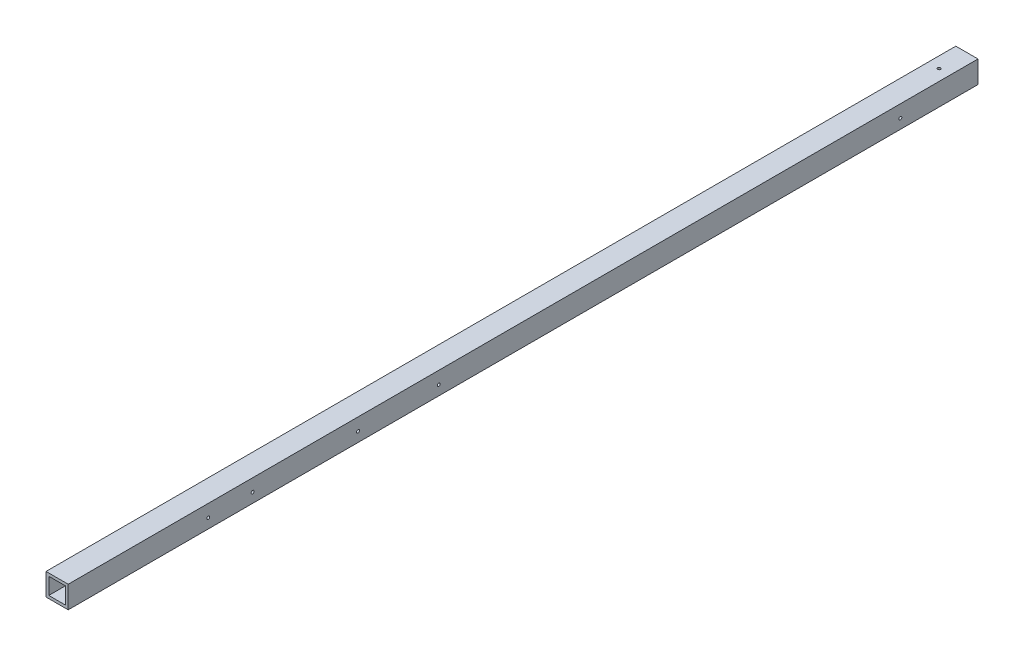
ISO-10303-21;
HEADER;
FILE_DESCRIPTION(('STEP AP214'),'2;1');
FILE_NAME('part.step','',(''),(''),'','','');
FILE_SCHEMA(('AUTOMOTIVE_DESIGN { 1 0 10303 214 1 1 1 1 }'));
ENDSEC;
DATA;
#1=APPLICATION_CONTEXT('core data for automotive mechanical design processes');
#2=APPLICATION_PROTOCOL_DEFINITION('international standard','automotive_design',2000,#1);
#3=PRODUCT_CONTEXT('',#1,'mechanical');
#4=PRODUCT('Part','Part','',(#3));
#5=PRODUCT_RELATED_PRODUCT_CATEGORY('part','',(#4));
#6=PRODUCT_DEFINITION_FORMATION('','',#4);
#7=PRODUCT_DEFINITION_CONTEXT('part definition',#1,'design');
#8=PRODUCT_DEFINITION('design','',#6,#7);
#9=PRODUCT_DEFINITION_SHAPE('','',#8);
#10=(LENGTH_UNIT() NAMED_UNIT(*) SI_UNIT(.MILLI.,.METRE.));
#11=(NAMED_UNIT(*) PLANE_ANGLE_UNIT() SI_UNIT($,.RADIAN.));
#12=(NAMED_UNIT(*) SI_UNIT($,.STERADIAN.) SOLID_ANGLE_UNIT());
#13=UNCERTAINTY_MEASURE_WITH_UNIT(LENGTH_MEASURE(1.E-05),#10,'distance_accuracy_value','');
#14=(GEOMETRIC_REPRESENTATION_CONTEXT(3) GLOBAL_UNCERTAINTY_ASSIGNED_CONTEXT((#13)) GLOBAL_UNIT_ASSIGNED_CONTEXT((#10,
#11,#12)) REPRESENTATION_CONTEXT('',''));
#15=CARTESIAN_POINT('',(0.,0.,0.));
#16=DIRECTION('',(0.,0.,1.));
#17=DIRECTION('',(1.,0.,0.));
#18=AXIS2_PLACEMENT_3D('',#15,#16,#17);
#19=CARTESIAN_POINT('',(-2287.62139438171,-193.675,1762.125));
#20=DIRECTION('',(1.,0.,0.));
#21=DIRECTION('',(0.,0.,-1.));
#22=AXIS2_PLACEMENT_3D('',#19,#20,#21);
#23=CYLINDRICAL_SURFACE('',#22,3.3782);
#24=CARTESIAN_POINT('',(-209.55,-193.675,1762.125));
#25=DIRECTION('',(1.,0.,0.));
#26=DIRECTION('',(0.,0.,-1.));
#27=AXIS2_PLACEMENT_3D('',#24,#25,#26);
#28=CIRCLE('',#27,3.3782);
#29=CARTESIAN_POINT('',(-209.55,-193.675,1758.7468));
#30=VERTEX_POINT('',#29);
#31=EDGE_CURVE('E157',#30,#30,#28,.F.);
#32=ORIENTED_EDGE('',*,*,#31,.F.);
#33=EDGE_LOOP('',(#32));
#34=FACE_BOUND('',#33,.T.);
#35=CARTESIAN_POINT('',(-212.028435125498,-193.675,1762.125));
#36=DIRECTION('',(-1.,0.,0.));
#37=DIRECTION('',(0.,0.,1.));
#38=AXIS2_PLACEMENT_3D('',#35,#36,#37);
#39=CIRCLE('',#38,3.3782);
#40=CARTESIAN_POINT('',(-212.028435125498,-193.675,1765.5032));
#41=VERTEX_POINT('',#40);
#42=EDGE_CURVE('E222',#41,#41,#39,.T.);
#43=ORIENTED_EDGE('',*,*,#42,.T.);
#44=EDGE_LOOP('',(#43));
#45=FACE_BOUND('',#44,.T.);
#46=ADVANCED_FACE('F14',(#34,#45),#23,.F.);
#47=CARTESIAN_POINT('',(-2287.62139438171,-193.675,1660.525));
#48=DIRECTION('',(1.,0.,0.));
#49=DIRECTION('',(0.,0.,-1.));
#50=AXIS2_PLACEMENT_3D('',#47,#48,#49);
#51=CYLINDRICAL_SURFACE('',#50,3.3782);
#52=CARTESIAN_POINT('',(-209.55,-193.675,1660.525));
#53=DIRECTION('',(1.,0.,0.));
#54=DIRECTION('',(0.,0.,-1.));
#55=AXIS2_PLACEMENT_3D('',#52,#53,#54);
#56=CIRCLE('',#55,3.3782);
#57=CARTESIAN_POINT('',(-209.55,-193.675,1657.1468));
#58=VERTEX_POINT('',#57);
#59=EDGE_CURVE('E163',#58,#58,#56,.F.);
#60=ORIENTED_EDGE('',*,*,#59,.F.);
#61=EDGE_LOOP('',(#60));
#62=FACE_BOUND('',#61,.T.);
#63=CARTESIAN_POINT('',(-212.028435125498,-193.675,1660.525));
#64=DIRECTION('',(-1.,0.,0.));
#65=DIRECTION('',(0.,0.,1.));
#66=AXIS2_PLACEMENT_3D('',#63,#64,#65);
#67=CIRCLE('',#66,3.3782);
#68=CARTESIAN_POINT('',(-212.028435125498,-193.675,1663.9032));
#69=VERTEX_POINT('',#68);
#70=EDGE_CURVE('E168',#69,#69,#67,.T.);
#71=ORIENTED_EDGE('',*,*,#70,.T.);
#72=EDGE_LOOP('',(#71));
#73=FACE_BOUND('',#72,.T.);
#74=ADVANCED_FACE('F330',(#62,#73),#51,.F.);
#75=CARTESIAN_POINT('',(-190.5,-171.45,2082.8));
#76=DIRECTION('',(0.,-1.,0.));
#77=DIRECTION('',(0.,0.,-1.));
#78=AXIS2_PLACEMENT_3D('',#75,#76,#77);
#79=PLANE('',#78);
#80=CARTESIAN_POINT('',(-190.5,-171.45,63.5));
#81=DIRECTION('',(0.,-1.,0.));
#82=DIRECTION('',(0.,0.,-1.));
#83=AXIS2_PLACEMENT_3D('',#80,#81,#82);
#84=CIRCLE('',#83,3.3655);
#85=CARTESIAN_POINT('',(-190.5,-171.45,60.1345));
#86=VERTEX_POINT('',#85);
#87=EDGE_CURVE('E252',#86,#86,#84,.F.);
#88=ORIENTED_EDGE('',*,*,#87,.T.);
#89=EDGE_LOOP('',(#88));
#90=FACE_BOUND('',#89,.T.);
#91=DIRECTION('',(-1.,0.,0.));
#92=VECTOR('',#91,1.);
#93=CARTESIAN_POINT('',(-190.5,-171.45,0.));
#94=LINE('',#93,#92);
#95=CARTESIAN_POINT('',(-171.45,-171.45,0.));
#96=VERTEX_POINT('',#95);
#97=CARTESIAN_POINT('',(-209.55,-171.45,0.));
#98=VERTEX_POINT('',#97);
#99=EDGE_CURVE('E289',#96,#98,#94,.T.);
#100=ORIENTED_EDGE('',*,*,#99,.F.);
#101=DIRECTION('',(0.,0.,-1.));
#102=VECTOR('',#101,1.);
#103=CARTESIAN_POINT('',(-171.45,-171.45,2082.8));
#104=LINE('',#103,#102);
#105=CARTESIAN_POINT('',(-171.45,-171.45,2082.8));
#106=VERTEX_POINT('',#105);
#107=EDGE_CURVE('E9',#106,#96,#104,.T.);
#108=ORIENTED_EDGE('',*,*,#107,.F.);
#109=DIRECTION('',(-1.,0.,0.));
#110=VECTOR('',#109,1.);
#111=CARTESIAN_POINT('',(-190.5,-171.45,2082.8));
#112=LINE('',#111,#110);
#113=CARTESIAN_POINT('',(-209.55,-171.45,2082.8));
#114=VERTEX_POINT('',#113);
#115=EDGE_CURVE('E124',#106,#114,#112,.T.);
#116=ORIENTED_EDGE('',*,*,#115,.T.);
#117=DIRECTION('',(0.,0.,-1.));
#118=VECTOR('',#117,1.);
#119=CARTESIAN_POINT('',(-209.55,-171.45,2082.8));
#120=LINE('',#119,#118);
#121=EDGE_CURVE('E39',#114,#98,#120,.T.);
#122=ORIENTED_EDGE('',*,*,#121,.T.);
#123=EDGE_LOOP('',(#100,#108,#116,#122));
#124=FACE_BOUND('',#123,.T.);
#125=ADVANCED_FACE('F337',(#90,#124),#79,.T.);
#126=CARTESIAN_POINT('',(-171.45,-190.5,2082.8));
#127=DIRECTION('',(1.,0.,0.));
#128=DIRECTION('',(0.,0.,-1.));
#129=AXIS2_PLACEMENT_3D('',#126,#127,#128);
#130=PLANE('',#129);
#131=CARTESIAN_POINT('',(-171.45,-193.675,1419.225));
#132=DIRECTION('',(1.,0.,0.));
#133=DIRECTION('',(0.,0.,-1.));
#134=AXIS2_PLACEMENT_3D('',#131,#132,#133);
#135=CIRCLE('',#134,3.3782);
#136=CARTESIAN_POINT('',(-171.45,-193.675,1415.8468));
#137=VERTEX_POINT('',#136);
#138=EDGE_CURVE('E198',#137,#137,#135,.F.);
#139=ORIENTED_EDGE('',*,*,#138,.F.);
#140=EDGE_LOOP('',(#139));
#141=FACE_BOUND('',#140,.T.);
#142=CARTESIAN_POINT('',(-171.45,-193.675,177.8));
#143=DIRECTION('',(1.,0.,0.));
#144=DIRECTION('',(0.,0.,-1.));
#145=AXIS2_PLACEMENT_3D('',#142,#143,#144);
#146=CIRCLE('',#145,3.3782);
#147=CARTESIAN_POINT('',(-171.45,-193.675,174.4218));
#148=VERTEX_POINT('',#147);
#149=EDGE_CURVE('E186',#148,#148,#146,.F.);
#150=ORIENTED_EDGE('',*,*,#149,.F.);
#151=EDGE_LOOP('',(#150));
#152=FACE_BOUND('',#151,.T.);
#153=CARTESIAN_POINT('',(-171.45,-193.675,1234.5416));
#154=DIRECTION('',(1.,0.,0.));
#155=DIRECTION('',(0.,0.,-1.));
#156=AXIS2_PLACEMENT_3D('',#153,#154,#155);
#157=CIRCLE('',#156,3.3782);
#158=CARTESIAN_POINT('',(-171.45,-193.675,1231.1634));
#159=VERTEX_POINT('',#158);
#160=EDGE_CURVE('E214',#159,#159,#157,.F.);
#161=ORIENTED_EDGE('',*,*,#160,.F.);
#162=EDGE_LOOP('',(#161));
#163=FACE_BOUND('',#162,.T.);
#164=CARTESIAN_POINT('',(-171.45,-193.675,1660.525));
#165=DIRECTION('',(1.,0.,0.));
#166=DIRECTION('',(0.,0.,-1.));
#167=AXIS2_PLACEMENT_3D('',#164,#165,#166);
#168=CIRCLE('',#167,3.3782);
#169=CARTESIAN_POINT('',(-171.45,-193.675,1657.1468));
#170=VERTEX_POINT('',#169);
#171=EDGE_CURVE('E162',#170,#170,#168,.F.);
#172=ORIENTED_EDGE('',*,*,#171,.F.);
#173=EDGE_LOOP('',(#172));
#174=FACE_BOUND('',#173,.T.);
#175=CARTESIAN_POINT('',(-171.45,-193.675,1762.125));
#176=DIRECTION('',(1.,0.,0.));
#177=DIRECTION('',(0.,0.,-1.));
#178=AXIS2_PLACEMENT_3D('',#175,#176,#177);
#179=CIRCLE('',#178,3.3782);
#180=CARTESIAN_POINT('',(-171.45,-193.675,1758.7468));
#181=VERTEX_POINT('',#180);
#182=EDGE_CURVE('E242',#181,#181,#179,.F.);
#183=ORIENTED_EDGE('',*,*,#182,.F.);
#184=EDGE_LOOP('',(#183));
#185=FACE_BOUND('',#184,.T.);
#186=DIRECTION('',(0.,-1.,0.));
#187=VECTOR('',#186,1.);
#188=CARTESIAN_POINT('',(-171.45,-190.5,0.));
#189=LINE('',#188,#187);
#190=CARTESIAN_POINT('',(-171.45,-209.55,0.));
#191=VERTEX_POINT('',#190);
#192=EDGE_CURVE('E130',#96,#191,#189,.T.);
#193=ORIENTED_EDGE('',*,*,#192,.T.);
#194=DIRECTION('',(0.,0.,-1.));
#195=VECTOR('',#194,1.);
#196=CARTESIAN_POINT('',(-171.45,-209.55,2082.8));
#197=LINE('',#196,#195);
#198=CARTESIAN_POINT('',(-171.45,-209.55,2082.8));
#199=VERTEX_POINT('',#198);
#200=EDGE_CURVE('E25',#199,#191,#197,.T.);
#201=ORIENTED_EDGE('',*,*,#200,.F.);
#202=DIRECTION('',(0.,-1.,0.));
#203=VECTOR('',#202,1.);
#204=CARTESIAN_POINT('',(-171.45,-190.5,2082.8));
#205=LINE('',#204,#203);
#206=EDGE_CURVE('E119',#106,#199,#205,.T.);
#207=ORIENTED_EDGE('',*,*,#206,.F.);
#208=ORIENTED_EDGE('',*,*,#107,.T.);
#209=EDGE_LOOP('',(#193,#201,#207,#208));
#210=FACE_BOUND('',#209,.T.);
#211=ADVANCED_FACE('F128',(#141,#152,#163,#174,#185,#210),#130,.F.);
#212=CARTESIAN_POINT('',(-190.5,-209.55,2082.8));
#213=DIRECTION('',(0.,-1.,0.));
#214=DIRECTION('',(0.,0.,-1.));
#215=AXIS2_PLACEMENT_3D('',#212,#213,#214);
#216=PLANE('',#215);
#217=CARTESIAN_POINT('',(-190.5,-209.55,63.5));
#218=DIRECTION('',(0.,-1.,0.));
#219=DIRECTION('',(0.,0.,-1.));
#220=AXIS2_PLACEMENT_3D('',#217,#218,#219);
#221=CIRCLE('',#220,3.3655);
#222=CARTESIAN_POINT('',(-190.5,-209.55,60.1345));
#223=VERTEX_POINT('',#222);
#224=EDGE_CURVE('E155',#223,#223,#221,.F.);
#225=ORIENTED_EDGE('',*,*,#224,.F.);
#226=EDGE_LOOP('',(#225));
#227=FACE_BOUND('',#226,.T.);
#228=DIRECTION('',(-1.,0.,0.));
#229=VECTOR('',#228,1.);
#230=CARTESIAN_POINT('',(-190.5,-209.55,0.));
#231=LINE('',#230,#229);
#232=CARTESIAN_POINT('',(-209.55,-209.55,0.));
#233=VERTEX_POINT('',#232);
#234=EDGE_CURVE('E294',#191,#233,#231,.T.);
#235=ORIENTED_EDGE('',*,*,#234,.T.);
#236=DIRECTION('',(0.,0.,-1.));
#237=VECTOR('',#236,1.);
#238=CARTESIAN_POINT('',(-209.55,-209.55,2082.8));
#239=LINE('',#238,#237);
#240=CARTESIAN_POINT('',(-209.55,-209.55,2082.8));
#241=VERTEX_POINT('',#240);
#242=EDGE_CURVE('E74',#241,#233,#239,.T.);
#243=ORIENTED_EDGE('',*,*,#242,.F.);
#244=DIRECTION('',(-1.,0.,0.));
#245=VECTOR('',#244,1.);
#246=CARTESIAN_POINT('',(-190.5,-209.55,2082.8));
#247=LINE('',#246,#245);
#248=EDGE_CURVE('E110',#199,#241,#247,.T.);
#249=ORIENTED_EDGE('',*,*,#248,.F.);
#250=ORIENTED_EDGE('',*,*,#200,.T.);
#251=EDGE_LOOP('',(#235,#243,#249,#250));
#252=FACE_BOUND('',#251,.T.);
#253=ADVANCED_FACE('F112',(#227,#252),#216,.F.);
#254=CARTESIAN_POINT('',(-215.9,-190.5,2082.8));
#255=DIRECTION('',(-1.,0.,0.));
#256=DIRECTION('',(0.,0.,1.));
#257=AXIS2_PLACEMENT_3D('',#254,#255,#256);
#258=PLANE('',#257);
#259=CARTESIAN_POINT('',(-215.9,-193.675,1419.225));
#260=DIRECTION('',(-1.,0.,0.));
#261=DIRECTION('',(0.,0.,1.));
#262=AXIS2_PLACEMENT_3D('',#259,#260,#261);
#263=CIRCLE('',#262,6.74369999999991);
#264=CARTESIAN_POINT('',(-215.9,-193.675,1425.9687));
#265=VERTEX_POINT('',#264);
#266=EDGE_CURVE('E592',#265,#265,#263,.T.);
#267=ORIENTED_EDGE('',*,*,#266,.F.);
#268=EDGE_LOOP('',(#267));
#269=FACE_BOUND('',#268,.T.);
#270=CARTESIAN_POINT('',(-215.9,-193.675,177.8));
#271=DIRECTION('',(-1.,0.,0.));
#272=DIRECTION('',(0.,0.,1.));
#273=AXIS2_PLACEMENT_3D('',#270,#271,#272);
#274=CIRCLE('',#273,6.7437);
#275=CARTESIAN_POINT('',(-215.9,-193.675,184.5437));
#276=VERTEX_POINT('',#275);
#277=EDGE_CURVE('E190',#276,#276,#274,.T.);
#278=ORIENTED_EDGE('',*,*,#277,.F.);
#279=EDGE_LOOP('',(#278));
#280=FACE_BOUND('',#279,.T.);
#281=CARTESIAN_POINT('',(-215.9,-193.675,1234.5416));
#282=DIRECTION('',(-1.,0.,0.));
#283=DIRECTION('',(0.,0.,1.));
#284=AXIS2_PLACEMENT_3D('',#281,#282,#283);
#285=CIRCLE('',#284,6.74369999999991);
#286=CARTESIAN_POINT('',(-215.9,-193.675,1241.2853));
#287=VERTEX_POINT('',#286);
#288=EDGE_CURVE('E204',#287,#287,#285,.T.);
#289=ORIENTED_EDGE('',*,*,#288,.F.);
#290=EDGE_LOOP('',(#289));
#291=FACE_BOUND('',#290,.T.);
#292=CARTESIAN_POINT('',(-215.9,-193.675,1762.125));
#293=DIRECTION('',(-1.,0.,0.));
#294=DIRECTION('',(0.,0.,1.));
#295=AXIS2_PLACEMENT_3D('',#292,#293,#294);
#296=CIRCLE('',#295,6.74369999999991);
#297=CARTESIAN_POINT('',(-215.9,-193.675,1768.8687));
#298=VERTEX_POINT('',#297);
#299=EDGE_CURVE('E218',#298,#298,#296,.T.);
#300=ORIENTED_EDGE('',*,*,#299,.F.);
#301=EDGE_LOOP('',(#300));
#302=FACE_BOUND('',#301,.T.);
#303=CARTESIAN_POINT('',(-215.9,-193.675,1660.525));
#304=DIRECTION('',(-1.,0.,0.));
#305=DIRECTION('',(0.,0.,1.));
#306=AXIS2_PLACEMENT_3D('',#303,#304,#305);
#307=CIRCLE('',#306,6.74369999999991);
#308=CARTESIAN_POINT('',(-215.9,-193.675,1667.2687));
#309=VERTEX_POINT('',#308);
#310=EDGE_CURVE('E226',#309,#309,#307,.T.);
#311=ORIENTED_EDGE('',*,*,#310,.F.);
#312=EDGE_LOOP('',(#311));
#313=FACE_BOUND('',#312,.T.);
#314=DIRECTION('',(0.,1.,0.));
#315=VECTOR('',#314,1.);
#316=CARTESIAN_POINT('',(-215.9,-190.5,0.));
#317=LINE('',#316,#315);
#318=CARTESIAN_POINT('',(-215.9,-215.9,0.));
#319=VERTEX_POINT('',#318);
#320=CARTESIAN_POINT('',(-215.9,-165.1,0.));
#321=VERTEX_POINT('',#320);
#322=EDGE_CURVE('E256',#319,#321,#317,.T.);
#323=ORIENTED_EDGE('',*,*,#322,.F.);
#324=DIRECTION('',(0.,0.,-1.));
#325=VECTOR('',#324,1.);
#326=CARTESIAN_POINT('',(-215.9,-215.9,2082.8));
#327=LINE('',#326,#325);
#328=CARTESIAN_POINT('',(-215.9,-215.9,2082.8));
#329=VERTEX_POINT('',#328);
#330=EDGE_CURVE('E90',#329,#319,#327,.T.);
#331=ORIENTED_EDGE('',*,*,#330,.F.);
#332=DIRECTION('',(0.,1.,0.));
#333=VECTOR('',#332,1.);
#334=CARTESIAN_POINT('',(-215.9,-190.5,2082.8));
#335=LINE('',#334,#333);
#336=CARTESIAN_POINT('',(-215.9,-165.1,2082.8));
#337=VERTEX_POINT('',#336);
#338=EDGE_CURVE('E257',#329,#337,#335,.T.);
#339=ORIENTED_EDGE('',*,*,#338,.T.);
#340=DIRECTION('',(0.,0.,-1.));
#341=VECTOR('',#340,1.);
#342=CARTESIAN_POINT('',(-215.9,-165.1,2082.8));
#343=LINE('',#342,#341);
#344=EDGE_CURVE('E139',#337,#321,#343,.T.);
#345=ORIENTED_EDGE('',*,*,#344,.T.);
#346=EDGE_LOOP('',(#323,#331,#339,#345));
#347=FACE_BOUND('',#346,.T.);
#348=ADVANCED_FACE('F16',(#269,#280,#291,#302,#313,#347),#258,.T.);
#349=CARTESIAN_POINT('',(-190.5,-215.9,2082.8));
#350=DIRECTION('',(0.,1.,0.));
#351=DIRECTION('',(0.,0.,1.));
#352=AXIS2_PLACEMENT_3D('',#349,#350,#351);
#353=PLANE('',#352);
#354=CARTESIAN_POINT('',(-190.5,-215.9,63.5));
#355=DIRECTION('',(0.,-1.,0.));
#356=DIRECTION('',(0.,0.,-1.));
#357=AXIS2_PLACEMENT_3D('',#354,#355,#356);
#358=CIRCLE('',#357,3.3655);
#359=CARTESIAN_POINT('',(-190.5,-215.9,60.1345));
#360=VERTEX_POINT('',#359);
#361=EDGE_CURVE('E156',#360,#360,#358,.T.);
#362=ORIENTED_EDGE('',*,*,#361,.F.);
#363=EDGE_LOOP('',(#362));
#364=FACE_BOUND('',#363,.T.);
#365=DIRECTION('',(1.,0.,0.));
#366=VECTOR('',#365,1.);
#367=CARTESIAN_POINT('',(-190.5,-215.9,0.));
#368=LINE('',#367,#366);
#369=CARTESIAN_POINT('',(-165.1,-215.9,0.));
#370=VERTEX_POINT('',#369);
#371=EDGE_CURVE('E278',#319,#370,#368,.T.);
#372=ORIENTED_EDGE('',*,*,#371,.T.);
#373=DIRECTION('',(0.,0.,-1.));
#374=VECTOR('',#373,1.);
#375=CARTESIAN_POINT('',(-165.1,-215.9,2082.8));
#376=LINE('',#375,#374);
#377=CARTESIAN_POINT('',(-165.1,-215.9,2082.8));
#378=VERTEX_POINT('',#377);
#379=EDGE_CURVE('E145',#378,#370,#376,.T.);
#380=ORIENTED_EDGE('',*,*,#379,.F.);
#381=DIRECTION('',(1.,0.,0.));
#382=VECTOR('',#381,1.);
#383=CARTESIAN_POINT('',(-190.5,-215.9,2082.8));
#384=LINE('',#383,#382);
#385=EDGE_CURVE('E260',#329,#378,#384,.T.);
#386=ORIENTED_EDGE('',*,*,#385,.F.);
#387=ORIENTED_EDGE('',*,*,#330,.T.);
#388=EDGE_LOOP('',(#372,#380,#386,#387));
#389=FACE_BOUND('',#388,.T.);
#390=ADVANCED_FACE('F373',(#364,#389),#353,.F.);
#391=CARTESIAN_POINT('',(-165.1,-190.5,2082.8));
#392=DIRECTION('',(-1.,0.,0.));
#393=DIRECTION('',(0.,0.,1.));
#394=AXIS2_PLACEMENT_3D('',#391,#392,#393);
#395=PLANE('',#394);
#396=CARTESIAN_POINT('',(-165.1,-193.675,1419.225));
#397=DIRECTION('',(-1.,0.,0.));
#398=DIRECTION('',(0.,0.,1.));
#399=AXIS2_PLACEMENT_3D('',#396,#397,#398);
#400=CIRCLE('',#399,3.3782);
#401=CARTESIAN_POINT('',(-165.1,-193.675,1422.6032));
#402=VERTEX_POINT('',#401);
#403=EDGE_CURVE('E552',#402,#402,#400,.F.);
#404=ORIENTED_EDGE('',*,*,#403,.F.);
#405=EDGE_LOOP('',(#404));
#406=FACE_BOUND('',#405,.T.);
#407=CARTESIAN_POINT('',(-165.1,-193.675,177.8));
#408=DIRECTION('',(-1.,0.,0.));
#409=DIRECTION('',(0.,0.,1.));
#410=AXIS2_PLACEMENT_3D('',#407,#408,#409);
#411=CIRCLE('',#410,3.3782);
#412=CARTESIAN_POINT('',(-165.1,-193.675,181.1782));
#413=VERTEX_POINT('',#412);
#414=EDGE_CURVE('E177',#413,#413,#411,.F.);
#415=ORIENTED_EDGE('',*,*,#414,.F.);
#416=EDGE_LOOP('',(#415));
#417=FACE_BOUND('',#416,.T.);
#418=CARTESIAN_POINT('',(-165.1,-193.675,1234.5416));
#419=DIRECTION('',(-1.,0.,0.));
#420=DIRECTION('',(0.,0.,1.));
#421=AXIS2_PLACEMENT_3D('',#418,#419,#420);
#422=CIRCLE('',#421,3.3782);
#423=CARTESIAN_POINT('',(-165.1,-193.675,1237.9198));
#424=VERTEX_POINT('',#423);
#425=EDGE_CURVE('E172',#424,#424,#422,.F.);
#426=ORIENTED_EDGE('',*,*,#425,.F.);
#427=EDGE_LOOP('',(#426));
#428=FACE_BOUND('',#427,.T.);
#429=CARTESIAN_POINT('',(-165.1,-193.675,1660.525));
#430=DIRECTION('',(-1.,0.,0.));
#431=DIRECTION('',(0.,0.,1.));
#432=AXIS2_PLACEMENT_3D('',#429,#430,#431);
#433=CIRCLE('',#432,3.3782);
#434=CARTESIAN_POINT('',(-165.1,-193.675,1663.9032));
#435=VERTEX_POINT('',#434);
#436=EDGE_CURVE('E167',#435,#435,#433,.F.);
#437=ORIENTED_EDGE('',*,*,#436,.F.);
#438=EDGE_LOOP('',(#437));
#439=FACE_BOUND('',#438,.T.);
#440=CARTESIAN_POINT('',(-165.1,-193.675,1762.125));
#441=DIRECTION('',(-1.,0.,0.));
#442=DIRECTION('',(0.,0.,1.));
#443=AXIS2_PLACEMENT_3D('',#440,#441,#442);
#444=CIRCLE('',#443,3.3782);
#445=CARTESIAN_POINT('',(-165.1,-193.675,1765.5032));
#446=VERTEX_POINT('',#445);
#447=EDGE_CURVE('E161',#446,#446,#444,.F.);
#448=ORIENTED_EDGE('',*,*,#447,.F.);
#449=EDGE_LOOP('',(#448));
#450=FACE_BOUND('',#449,.T.);
#451=DIRECTION('',(0.,1.,0.));
#452=VECTOR('',#451,1.);
#453=CARTESIAN_POINT('',(-165.1,-190.5,0.));
#454=LINE('',#453,#452);
#455=CARTESIAN_POINT('',(-165.1,-165.1,0.));
#456=VERTEX_POINT('',#455);
#457=EDGE_CURVE('E281',#370,#456,#454,.T.);
#458=ORIENTED_EDGE('',*,*,#457,.T.);
#459=DIRECTION('',(0.,0.,-1.));
#460=VECTOR('',#459,1.);
#461=CARTESIAN_POINT('',(-165.1,-165.1,2082.8));
#462=LINE('',#461,#460);
#463=CARTESIAN_POINT('',(-165.1,-165.1,2082.8));
#464=VERTEX_POINT('',#463);
#465=EDGE_CURVE('E142',#464,#456,#462,.T.);
#466=ORIENTED_EDGE('',*,*,#465,.F.);
#467=DIRECTION('',(0.,1.,0.));
#468=VECTOR('',#467,1.);
#469=CARTESIAN_POINT('',(-165.1,-190.5,2082.8));
#470=LINE('',#469,#468);
#471=EDGE_CURVE('E264',#378,#464,#470,.T.);
#472=ORIENTED_EDGE('',*,*,#471,.F.);
#473=ORIENTED_EDGE('',*,*,#379,.T.);
#474=EDGE_LOOP('',(#458,#466,#472,#473));
#475=FACE_BOUND('',#474,.T.);
#476=ADVANCED_FACE('F323',(#406,#417,#428,#439,#450,#475),#395,.F.);
#477=CARTESIAN_POINT('',(-190.5,-165.1,2082.8));
#478=DIRECTION('',(0.,1.,0.));
#479=DIRECTION('',(0.,0.,1.));
#480=AXIS2_PLACEMENT_3D('',#477,#478,#479);
#481=PLANE('',#480);
#482=CARTESIAN_POINT('',(-190.5,-165.1,63.5));
#483=DIRECTION('',(0.,1.,0.));
#484=DIRECTION('',(0.,0.,1.));
#485=AXIS2_PLACEMENT_3D('',#482,#483,#484);
#486=CIRCLE('',#485,3.3655);
#487=CARTESIAN_POINT('',(-190.5,-165.1,66.8655));
#488=VERTEX_POINT('',#487);
#489=EDGE_CURVE('E151',#488,#488,#486,.F.);
#490=ORIENTED_EDGE('',*,*,#489,.T.);
#491=EDGE_LOOP('',(#490));
#492=FACE_BOUND('',#491,.T.);
#493=DIRECTION('',(1.,0.,0.));
#494=VECTOR('',#493,1.);
#495=CARTESIAN_POINT('',(-190.5,-165.1,0.));
#496=LINE('',#495,#494);
#497=EDGE_CURVE('E285',#321,#456,#496,.T.);
#498=ORIENTED_EDGE('',*,*,#497,.F.);
#499=ORIENTED_EDGE('',*,*,#344,.F.);
#500=DIRECTION('',(1.,0.,0.));
#501=VECTOR('',#500,1.);
#502=CARTESIAN_POINT('',(-190.5,-165.1,2082.8));
#503=LINE('',#502,#501);
#504=EDGE_CURVE('E267',#337,#464,#503,.T.);
#505=ORIENTED_EDGE('',*,*,#504,.T.);
#506=ORIENTED_EDGE('',*,*,#465,.T.);
#507=EDGE_LOOP('',(#498,#499,#505,#506));
#508=FACE_BOUND('',#507,.T.);
#509=ADVANCED_FACE('F313',(#492,#508),#481,.T.);
#510=CARTESIAN_POINT('',(-209.55,-190.5,2082.8));
#511=DIRECTION('',(1.,0.,0.));
#512=DIRECTION('',(0.,0.,-1.));
#513=AXIS2_PLACEMENT_3D('',#510,#511,#512);
#514=PLANE('',#513);
#515=CARTESIAN_POINT('',(-209.55,-193.675,1419.225));
#516=DIRECTION('',(1.,0.,0.));
#517=DIRECTION('',(0.,0.,-1.));
#518=AXIS2_PLACEMENT_3D('',#515,#516,#517);
#519=CIRCLE('',#518,3.3782);
#520=CARTESIAN_POINT('',(-209.55,-193.675,1415.8468));
#521=VERTEX_POINT('',#520);
#522=EDGE_CURVE('E18',#521,#521,#519,.F.);
#523=ORIENTED_EDGE('',*,*,#522,.T.);
#524=EDGE_LOOP('',(#523));
#525=FACE_BOUND('',#524,.T.);
#526=CARTESIAN_POINT('',(-209.55,-193.675,177.8));
#527=DIRECTION('',(1.,0.,0.));
#528=DIRECTION('',(0.,0.,-1.));
#529=AXIS2_PLACEMENT_3D('',#526,#527,#528);
#530=CIRCLE('',#529,3.3782);
#531=CARTESIAN_POINT('',(-209.55,-193.675,174.4218));
#532=VERTEX_POINT('',#531);
#533=EDGE_CURVE('E174',#532,#532,#530,.F.);
#534=ORIENTED_EDGE('',*,*,#533,.T.);
#535=EDGE_LOOP('',(#534));
#536=FACE_BOUND('',#535,.T.);
#537=CARTESIAN_POINT('',(-209.55,-193.675,1234.5416));
#538=DIRECTION('',(1.,0.,0.));
#539=DIRECTION('',(0.,0.,-1.));
#540=AXIS2_PLACEMENT_3D('',#537,#538,#539);
#541=CIRCLE('',#540,3.3782);
#542=CARTESIAN_POINT('',(-209.55,-193.675,1231.1634));
#543=VERTEX_POINT('',#542);
#544=EDGE_CURVE('E169',#543,#543,#541,.F.);
#545=ORIENTED_EDGE('',*,*,#544,.T.);
#546=EDGE_LOOP('',(#545));
#547=FACE_BOUND('',#546,.T.);
#548=ORIENTED_EDGE('',*,*,#59,.T.);
#549=EDGE_LOOP('',(#548));
#550=FACE_BOUND('',#549,.T.);
#551=ORIENTED_EDGE('',*,*,#31,.T.);
#552=EDGE_LOOP('',(#551));
#553=FACE_BOUND('',#552,.T.);
#554=DIRECTION('',(0.,-1.,0.));
#555=VECTOR('',#554,1.);
#556=CARTESIAN_POINT('',(-209.55,-190.5,0.));
#557=LINE('',#556,#555);
#558=EDGE_CURVE('E261',#98,#233,#557,.T.);
#559=ORIENTED_EDGE('',*,*,#558,.F.);
#560=ORIENTED_EDGE('',*,*,#121,.F.);
#561=DIRECTION('',(0.,-1.,0.));
#562=VECTOR('',#561,1.);
#563=CARTESIAN_POINT('',(-209.55,-190.5,2082.8));
#564=LINE('',#563,#562);
#565=EDGE_CURVE('E118',#114,#241,#564,.T.);
#566=ORIENTED_EDGE('',*,*,#565,.T.);
#567=ORIENTED_EDGE('',*,*,#242,.T.);
#568=EDGE_LOOP('',(#559,#560,#566,#567));
#569=FACE_BOUND('',#568,.T.);
#570=ADVANCED_FACE('F311',(#525,#536,#547,#550,#553,#569),#514,.T.);
#571=CARTESIAN_POINT('',(-190.5,-190.5,2082.8));
#572=DIRECTION('',(0.,0.,1.));
#573=DIRECTION('',(1.,0.,0.));
#574=AXIS2_PLACEMENT_3D('',#571,#572,#573);
#575=PLANE('',#574);
#576=ORIENTED_EDGE('',*,*,#338,.F.);
#577=ORIENTED_EDGE('',*,*,#385,.T.);
#578=ORIENTED_EDGE('',*,*,#471,.T.);
#579=ORIENTED_EDGE('',*,*,#504,.F.);
#580=EDGE_LOOP('',(#576,#577,#578,#579));
#581=FACE_BOUND('',#580,.T.);
#582=ORIENTED_EDGE('',*,*,#115,.F.);
#583=ORIENTED_EDGE('',*,*,#206,.T.);
#584=ORIENTED_EDGE('',*,*,#248,.T.);
#585=ORIENTED_EDGE('',*,*,#565,.F.);
#586=EDGE_LOOP('',(#582,#583,#584,#585));
#587=FACE_BOUND('',#586,.T.);
#588=ADVANCED_FACE('F123',(#581,#587),#575,.T.);
#589=CARTESIAN_POINT('',(-190.5,-190.5,0.));
#590=DIRECTION('',(0.,0.,1.));
#591=DIRECTION('',(1.,0.,0.));
#592=AXIS2_PLACEMENT_3D('',#589,#590,#591);
#593=PLANE('',#592);
#594=ORIENTED_EDGE('',*,*,#322,.T.);
#595=ORIENTED_EDGE('',*,*,#497,.T.);
#596=ORIENTED_EDGE('',*,*,#457,.F.);
#597=ORIENTED_EDGE('',*,*,#371,.F.);
#598=EDGE_LOOP('',(#594,#595,#596,#597));
#599=FACE_BOUND('',#598,.T.);
#600=ORIENTED_EDGE('',*,*,#99,.T.);
#601=ORIENTED_EDGE('',*,*,#558,.T.);
#602=ORIENTED_EDGE('',*,*,#234,.F.);
#603=ORIENTED_EDGE('',*,*,#192,.F.);
#604=EDGE_LOOP('',(#600,#601,#602,#603));
#605=FACE_BOUND('',#604,.T.);
#606=ADVANCED_FACE('F310',(#599,#605),#593,.F.);
#607=CARTESIAN_POINT('',(-190.5,1869.1497542781,63.5));
#608=DIRECTION('',(0.,-1.,0.));
#609=DIRECTION('',(0.,0.,-1.));
#610=AXIS2_PLACEMENT_3D('',#607,#608,#609);
#611=CYLINDRICAL_SURFACE('',#610,3.3655);
#612=ORIENTED_EDGE('',*,*,#87,.F.);
#613=EDGE_LOOP('',(#612));
#614=FACE_BOUND('',#613,.T.);
#615=ORIENTED_EDGE('',*,*,#489,.F.);
#616=EDGE_LOOP('',(#615));
#617=FACE_BOUND('',#616,.T.);
#618=ADVANCED_FACE('F353',(#614,#617),#611,.F.);
#619=ORIENTED_EDGE('',*,*,#361,.T.);
#620=EDGE_LOOP('',(#619));
#621=FACE_BOUND('',#620,.T.);
#622=ORIENTED_EDGE('',*,*,#224,.T.);
#623=EDGE_LOOP('',(#622));
#624=FACE_BOUND('',#623,.T.);
#625=ADVANCED_FACE('F345',(#621,#624),#611,.F.);
#626=ORIENTED_EDGE('',*,*,#447,.T.);
#627=EDGE_LOOP('',(#626));
#628=FACE_BOUND('',#627,.T.);
#629=ORIENTED_EDGE('',*,*,#182,.T.);
#630=EDGE_LOOP('',(#629));
#631=FACE_BOUND('',#630,.T.);
#632=ADVANCED_FACE('F333',(#628,#631),#23,.F.);
#633=ORIENTED_EDGE('',*,*,#436,.T.);
#634=EDGE_LOOP('',(#633));
#635=FACE_BOUND('',#634,.T.);
#636=ORIENTED_EDGE('',*,*,#171,.T.);
#637=EDGE_LOOP('',(#636));
#638=FACE_BOUND('',#637,.T.);
#639=ADVANCED_FACE('F340',(#635,#638),#51,.F.);
#640=CARTESIAN_POINT('',(-212.028435125498,-193.675,1660.525));
#641=DIRECTION('',(-1.,0.,0.));
#642=DIRECTION('',(0.,0.,1.));
#643=AXIS2_PLACEMENT_3D('',#640,#641,#642);
#644=CONICAL_SURFACE('',#643,3.3782,0.715584993317698);
#645=ORIENTED_EDGE('',*,*,#310,.T.);
#646=EDGE_LOOP('',(#645));
#647=FACE_BOUND('',#646,.T.);
#648=ORIENTED_EDGE('',*,*,#70,.F.);
#649=EDGE_LOOP('',(#648));
#650=FACE_BOUND('',#649,.T.);
#651=ADVANCED_FACE('F351',(#647,#650),#644,.F.);
#652=CARTESIAN_POINT('',(-212.028435125498,-193.675,1762.125));
#653=DIRECTION('',(-1.,0.,0.));
#654=DIRECTION('',(0.,0.,1.));
#655=AXIS2_PLACEMENT_3D('',#652,#653,#654);
#656=CONICAL_SURFACE('',#655,3.3782,0.715584993317698);
#657=ORIENTED_EDGE('',*,*,#299,.T.);
#658=EDGE_LOOP('',(#657));
#659=FACE_BOUND('',#658,.T.);
#660=ORIENTED_EDGE('',*,*,#42,.F.);
#661=EDGE_LOOP('',(#660));
#662=FACE_BOUND('',#661,.T.);
#663=ADVANCED_FACE('F435',(#659,#662),#656,.F.);
#664=CARTESIAN_POINT('',(1869.15356974302,-193.675,1234.5416));
#665=DIRECTION('',(-1.,0.,0.));
#666=DIRECTION('',(0.,0.,1.));
#667=AXIS2_PLACEMENT_3D('',#664,#665,#666);
#668=CYLINDRICAL_SURFACE('',#667,3.3782);
#669=ORIENTED_EDGE('',*,*,#544,.F.);
#670=EDGE_LOOP('',(#669));
#671=FACE_BOUND('',#670,.T.);
#672=CARTESIAN_POINT('',(-212.028435125498,-193.675,1234.5416));
#673=DIRECTION('',(-1.,0.,0.));
#674=DIRECTION('',(0.,0.,1.));
#675=AXIS2_PLACEMENT_3D('',#672,#673,#674);
#676=CIRCLE('',#675,3.3782);
#677=CARTESIAN_POINT('',(-212.028435125498,-193.675,1237.9198));
#678=VERTEX_POINT('',#677);
#679=EDGE_CURVE('E173',#678,#678,#676,.T.);
#680=ORIENTED_EDGE('',*,*,#679,.T.);
#681=EDGE_LOOP('',(#680));
#682=FACE_BOUND('',#681,.T.);
#683=ADVANCED_FACE('F446',(#671,#682),#668,.F.);
#684=CARTESIAN_POINT('',(-212.028435125498,-193.675,1234.5416));
#685=DIRECTION('',(-1.,0.,0.));
#686=DIRECTION('',(0.,0.,1.));
#687=AXIS2_PLACEMENT_3D('',#684,#685,#686);
#688=CONICAL_SURFACE('',#687,3.3782,0.715584993317698);
#689=ORIENTED_EDGE('',*,*,#288,.T.);
#690=EDGE_LOOP('',(#689));
#691=FACE_BOUND('',#690,.T.);
#692=ORIENTED_EDGE('',*,*,#679,.F.);
#693=EDGE_LOOP('',(#692));
#694=FACE_BOUND('',#693,.T.);
#695=ADVANCED_FACE('F457',(#691,#694),#688,.F.);
#696=ORIENTED_EDGE('',*,*,#425,.T.);
#697=EDGE_LOOP('',(#696));
#698=FACE_BOUND('',#697,.T.);
#699=ORIENTED_EDGE('',*,*,#160,.T.);
#700=EDGE_LOOP('',(#699));
#701=FACE_BOUND('',#700,.T.);
#702=ADVANCED_FACE('F460',(#698,#701),#668,.F.);
#703=CARTESIAN_POINT('',(1869.15356974302,-193.675,177.8));
#704=DIRECTION('',(-1.,0.,0.));
#705=DIRECTION('',(0.,0.,1.));
#706=AXIS2_PLACEMENT_3D('',#703,#704,#705);
#707=CYLINDRICAL_SURFACE('',#706,3.3782);
#708=ORIENTED_EDGE('',*,*,#533,.F.);
#709=EDGE_LOOP('',(#708));
#710=FACE_BOUND('',#709,.T.);
#711=CARTESIAN_POINT('',(-212.028435125498,-193.675,177.8));
#712=DIRECTION('',(-1.,0.,0.));
#713=DIRECTION('',(0.,0.,1.));
#714=AXIS2_PLACEMENT_3D('',#711,#712,#713);
#715=CIRCLE('',#714,3.3782);
#716=CARTESIAN_POINT('',(-212.028435125498,-193.675,181.1782));
#717=VERTEX_POINT('',#716);
#718=EDGE_CURVE('E178',#717,#717,#715,.T.);
#719=ORIENTED_EDGE('',*,*,#718,.T.);
#720=EDGE_LOOP('',(#719));
#721=FACE_BOUND('',#720,.T.);
#722=ADVANCED_FACE('F479',(#710,#721),#707,.F.);
#723=CARTESIAN_POINT('',(-212.028435125498,-193.675,177.8));
#724=DIRECTION('',(-1.,0.,0.));
#725=DIRECTION('',(0.,0.,1.));
#726=AXIS2_PLACEMENT_3D('',#723,#724,#725);
#727=CONICAL_SURFACE('',#726,3.3782,0.71558499331771);
#728=ORIENTED_EDGE('',*,*,#277,.T.);
#729=EDGE_LOOP('',(#728));
#730=FACE_BOUND('',#729,.T.);
#731=ORIENTED_EDGE('',*,*,#718,.F.);
#732=EDGE_LOOP('',(#731));
#733=FACE_BOUND('',#732,.T.);
#734=ADVANCED_FACE('F489',(#730,#733),#727,.F.);
#735=ORIENTED_EDGE('',*,*,#414,.T.);
#736=EDGE_LOOP('',(#735));
#737=FACE_BOUND('',#736,.T.);
#738=ORIENTED_EDGE('',*,*,#149,.T.);
#739=EDGE_LOOP('',(#738));
#740=FACE_BOUND('',#739,.T.);
#741=ADVANCED_FACE('F492',(#737,#740),#707,.F.);
#742=CARTESIAN_POINT('',(1912.81031480401,-193.675,1419.225));
#743=DIRECTION('',(-1.,0.,0.));
#744=DIRECTION('',(0.,0.,1.));
#745=AXIS2_PLACEMENT_3D('',#742,#743,#744);
#746=CYLINDRICAL_SURFACE('',#745,3.3782);
#747=ORIENTED_EDGE('',*,*,#522,.F.);
#748=EDGE_LOOP('',(#747));
#749=FACE_BOUND('',#748,.T.);
#750=CARTESIAN_POINT('',(-212.028435125498,-193.675,1419.225));
#751=DIRECTION('',(-1.,0.,0.));
#752=DIRECTION('',(0.,0.,1.));
#753=AXIS2_PLACEMENT_3D('',#750,#751,#752);
#754=CIRCLE('',#753,3.3782);
#755=CARTESIAN_POINT('',(-212.028435125498,-193.675,1422.6032));
#756=VERTEX_POINT('',#755);
#757=EDGE_CURVE('E553',#756,#756,#754,.T.);
#758=ORIENTED_EDGE('',*,*,#757,.T.);
#759=EDGE_LOOP('',(#758));
#760=FACE_BOUND('',#759,.T.);
#761=ADVANCED_FACE('F509',(#749,#760),#746,.F.);
#762=CARTESIAN_POINT('',(-212.028435125498,-193.675,1419.225));
#763=DIRECTION('',(-1.,0.,0.));
#764=DIRECTION('',(0.,0.,1.));
#765=AXIS2_PLACEMENT_3D('',#762,#763,#764);
#766=CONICAL_SURFACE('',#765,3.3782,0.715584993317756);
#767=ORIENTED_EDGE('',*,*,#266,.T.);
#768=EDGE_LOOP('',(#767));
#769=FACE_BOUND('',#768,.T.);
#770=ORIENTED_EDGE('',*,*,#757,.F.);
#771=EDGE_LOOP('',(#770));
#772=FACE_BOUND('',#771,.T.);
#773=ADVANCED_FACE('F519',(#769,#772),#766,.F.);
#774=ORIENTED_EDGE('',*,*,#403,.T.);
#775=EDGE_LOOP('',(#774));
#776=FACE_BOUND('',#775,.T.);
#777=ORIENTED_EDGE('',*,*,#138,.T.);
#778=EDGE_LOOP('',(#777));
#779=FACE_BOUND('',#778,.T.);
#780=ADVANCED_FACE('F522',(#776,#779),#746,.F.);
#781=CLOSED_SHELL('',(#46,#74,#125,#211,#253,#348,#390,#476,#509,#570,#588,#606,#618,#625,#632,
#639,#651,#663,#683,#695,#702,#722,#734,#741,#761,#773,#780));
#782=MANIFOLD_SOLID_BREP('B1',#781);
#783=ADVANCED_BREP_SHAPE_REPRESENTATION('',(#18,#782),#14);
#784=SHAPE_DEFINITION_REPRESENTATION(#9,#783);
ENDSEC;
END-ISO-10303-21;
